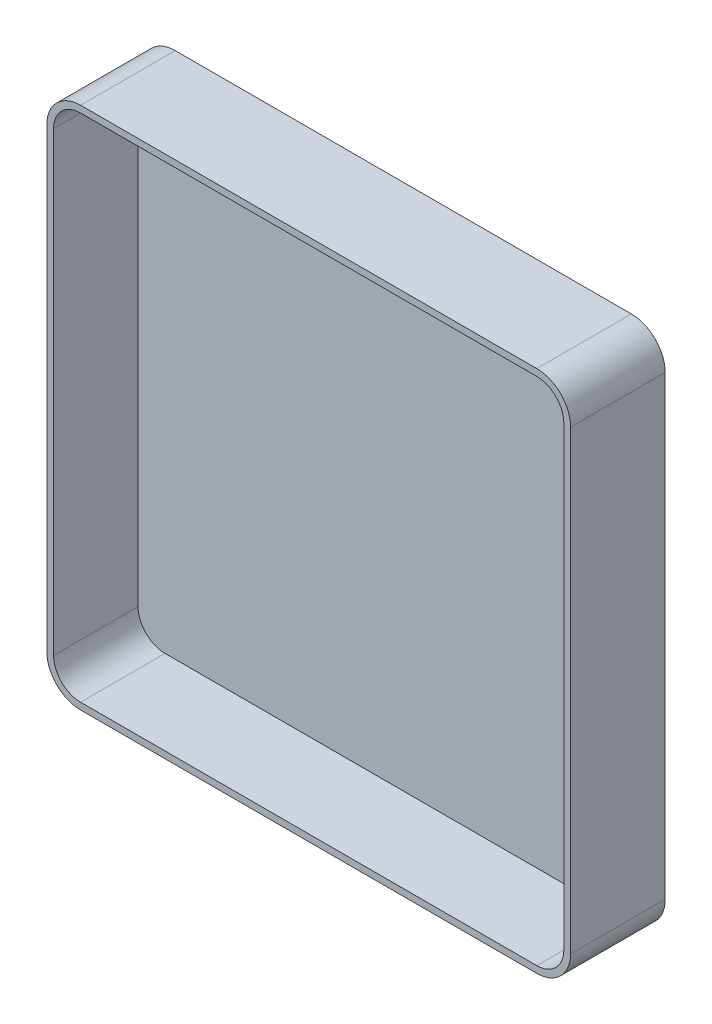
ISO-10303-21;
HEADER;
FILE_DESCRIPTION(('STEP AP214'),'2;1');
FILE_NAME('part.step','',(''),(''),'','','');
FILE_SCHEMA(('AUTOMOTIVE_DESIGN { 1 0 10303 214 1 1 1 1 }'));
ENDSEC;
DATA;
#1=APPLICATION_CONTEXT('core data for automotive mechanical design processes');
#2=APPLICATION_PROTOCOL_DEFINITION('international standard','automotive_design',2000,#1);
#3=PRODUCT_CONTEXT('',#1,'mechanical');
#4=PRODUCT('Part','Part','',(#3));
#5=PRODUCT_RELATED_PRODUCT_CATEGORY('part','',(#4));
#6=PRODUCT_DEFINITION_FORMATION('','',#4);
#7=PRODUCT_DEFINITION_CONTEXT('part definition',#1,'design');
#8=PRODUCT_DEFINITION('design','',#6,#7);
#9=PRODUCT_DEFINITION_SHAPE('','',#8);
#10=(LENGTH_UNIT() NAMED_UNIT(*) SI_UNIT(.MILLI.,.METRE.));
#11=(NAMED_UNIT(*) PLANE_ANGLE_UNIT() SI_UNIT($,.RADIAN.));
#12=(NAMED_UNIT(*) SI_UNIT($,.STERADIAN.) SOLID_ANGLE_UNIT());
#13=UNCERTAINTY_MEASURE_WITH_UNIT(LENGTH_MEASURE(1.E-05),#10,'distance_accuracy_value','');
#14=(GEOMETRIC_REPRESENTATION_CONTEXT(3) GLOBAL_UNCERTAINTY_ASSIGNED_CONTEXT((#13)) GLOBAL_UNIT_ASSIGNED_CONTEXT((#10,
#11,#12)) REPRESENTATION_CONTEXT('',''));
#15=CARTESIAN_POINT('',(0.,0.,0.));
#16=DIRECTION('',(0.,0.,1.));
#17=DIRECTION('',(1.,0.,0.));
#18=AXIS2_PLACEMENT_3D('',#15,#16,#17);
#19=CARTESIAN_POINT('',(414.301234579358,22.7440750856867,3.));
#20=DIRECTION('',(0.,0.,-1.));
#21=DIRECTION('',(-1.,0.,0.));
#22=AXIS2_PLACEMENT_3D('',#19,#20,#21);
#23=CYLINDRICAL_SURFACE('',#22,10.);
#24=CARTESIAN_POINT('',(414.301234579358,22.7440750856867,0.));
#25=DIRECTION('',(0.,0.,1.));
#26=DIRECTION('',(-1.,0.,0.));
#27=AXIS2_PLACEMENT_3D('',#24,#25,#26);
#28=CIRCLE('',#27,10.);
#29=CARTESIAN_POINT('',(404.301234579358,22.7440750856867,0.));
#30=VERTEX_POINT('',#29);
#31=CARTESIAN_POINT('',(414.301234579358,12.7440750856867,0.));
#32=VERTEX_POINT('',#31);
#33=EDGE_CURVE('E245',#30,#32,#28,.T.);
#34=ORIENTED_EDGE('',*,*,#33,.T.);
#35=DIRECTION('',(0.,0.,-1.));
#36=VECTOR('',#35,1.);
#37=CARTESIAN_POINT('',(414.301234579358,12.7440750856867,3.));
#38=LINE('',#37,#36);
#39=CARTESIAN_POINT('',(414.301234579358,12.7440750856867,28.));
#40=VERTEX_POINT('',#39);
#41=EDGE_CURVE('E11',#40,#32,#38,.T.);
#42=ORIENTED_EDGE('',*,*,#41,.F.);
#43=CARTESIAN_POINT('',(414.301234579358,22.7440750856867,28.));
#44=DIRECTION('',(0.,0.,1.));
#45=DIRECTION('',(1.,0.,0.));
#46=AXIS2_PLACEMENT_3D('',#43,#44,#45);
#47=CIRCLE('',#46,10.);
#48=CARTESIAN_POINT('',(404.301234579358,22.7440750856867,28.));
#49=VERTEX_POINT('',#48);
#50=EDGE_CURVE('E169',#49,#40,#47,.T.);
#51=ORIENTED_EDGE('',*,*,#50,.F.);
#52=DIRECTION('',(0.,0.,-1.));
#53=VECTOR('',#52,1.);
#54=CARTESIAN_POINT('',(404.301234579358,22.7440750856867,3.));
#55=LINE('',#54,#53);
#56=EDGE_CURVE('E261',#49,#30,#55,.T.);
#57=ORIENTED_EDGE('',*,*,#56,.T.);
#58=EDGE_LOOP('',(#34,#42,#51,#57));
#59=FACE_BOUND('',#58,.T.);
#60=ADVANCED_FACE('F39',(#59),#23,.T.);
#61=CARTESIAN_POINT('',(414.301234579358,12.7440750856867,3.));
#62=DIRECTION('',(0.,1.,0.));
#63=DIRECTION('',(0.,0.,1.));
#64=AXIS2_PLACEMENT_3D('',#61,#62,#63);
#65=PLANE('',#64);
#66=DIRECTION('',(1.,0.,0.));
#67=VECTOR('',#66,1.);
#68=CARTESIAN_POINT('',(414.301234579358,12.7440750856867,0.));
#69=LINE('',#68,#67);
#70=CARTESIAN_POINT('',(549.301234579366,12.7440750856867,0.));
#71=VERTEX_POINT('',#70);
#72=EDGE_CURVE('E248',#32,#71,#69,.T.);
#73=ORIENTED_EDGE('',*,*,#72,.T.);
#74=DIRECTION('',(0.,0.,-1.));
#75=VECTOR('',#74,1.);
#76=CARTESIAN_POINT('',(549.301234579366,12.7440750856867,3.));
#77=LINE('',#76,#75);
#78=CARTESIAN_POINT('',(549.301234579366,12.7440750856867,28.));
#79=VERTEX_POINT('',#78);
#80=EDGE_CURVE('E46',#79,#71,#77,.T.);
#81=ORIENTED_EDGE('',*,*,#80,.F.);
#82=DIRECTION('',(1.,0.,0.));
#83=VECTOR('',#82,1.);
#84=CARTESIAN_POINT('',(414.301234579358,12.7440750856867,28.));
#85=LINE('',#84,#83);
#86=EDGE_CURVE('E224',#40,#79,#85,.T.);
#87=ORIENTED_EDGE('',*,*,#86,.F.);
#88=ORIENTED_EDGE('',*,*,#41,.T.);
#89=EDGE_LOOP('',(#73,#81,#87,#88));
#90=FACE_BOUND('',#89,.T.);
#91=ADVANCED_FACE('F307',(#90),#65,.F.);
#92=CARTESIAN_POINT('',(549.301234579366,22.7440750856867,3.));
#93=DIRECTION('',(0.,0.,-1.));
#94=DIRECTION('',(-1.,0.,0.));
#95=AXIS2_PLACEMENT_3D('',#92,#93,#94);
#96=CYLINDRICAL_SURFACE('',#95,10.);
#97=CARTESIAN_POINT('',(549.301234579366,22.7440750856867,0.));
#98=DIRECTION('',(0.,0.,1.));
#99=DIRECTION('',(1.,0.,0.));
#100=AXIS2_PLACEMENT_3D('',#97,#98,#99);
#101=CIRCLE('',#100,10.);
#102=CARTESIAN_POINT('',(559.301234579366,22.7440750856867,0.));
#103=VERTEX_POINT('',#102);
#104=EDGE_CURVE('E250',#71,#103,#101,.T.);
#105=ORIENTED_EDGE('',*,*,#104,.T.);
#106=DIRECTION('',(0.,0.,-1.));
#107=VECTOR('',#106,1.);
#108=CARTESIAN_POINT('',(559.301234579366,22.7440750856867,3.));
#109=LINE('',#108,#107);
#110=CARTESIAN_POINT('',(559.301234579366,22.7440750856867,28.));
#111=VERTEX_POINT('',#110);
#112=EDGE_CURVE('E274',#111,#103,#109,.T.);
#113=ORIENTED_EDGE('',*,*,#112,.F.);
#114=CARTESIAN_POINT('',(549.301234579366,22.7440750856867,28.));
#115=DIRECTION('',(0.,0.,1.));
#116=DIRECTION('',(1.,0.,0.));
#117=AXIS2_PLACEMENT_3D('',#114,#115,#116);
#118=CIRCLE('',#117,10.);
#119=EDGE_CURVE('E227',#79,#111,#118,.T.);
#120=ORIENTED_EDGE('',*,*,#119,.F.);
#121=ORIENTED_EDGE('',*,*,#80,.T.);
#122=EDGE_LOOP('',(#105,#113,#120,#121));
#123=FACE_BOUND('',#122,.T.);
#124=ADVANCED_FACE('F280',(#123),#96,.T.);
#125=CARTESIAN_POINT('',(559.301234579366,22.7440750856867,3.));
#126=DIRECTION('',(-1.,0.,0.));
#127=DIRECTION('',(0.,0.,1.));
#128=AXIS2_PLACEMENT_3D('',#125,#126,#127);
#129=PLANE('',#128);
#130=DIRECTION('',(0.,1.,0.));
#131=VECTOR('',#130,1.);
#132=CARTESIAN_POINT('',(559.301234579366,22.7440750856867,0.));
#133=LINE('',#132,#131);
#134=CARTESIAN_POINT('',(559.301234579366,157.744075085687,0.));
#135=VERTEX_POINT('',#134);
#136=EDGE_CURVE('E252',#103,#135,#133,.T.);
#137=ORIENTED_EDGE('',*,*,#136,.T.);
#138=DIRECTION('',(0.,0.,-1.));
#139=VECTOR('',#138,1.);
#140=CARTESIAN_POINT('',(559.301234579366,157.744075085687,3.));
#141=LINE('',#140,#139);
#142=CARTESIAN_POINT('',(559.301234579366,157.744075085687,28.));
#143=VERTEX_POINT('',#142);
#144=EDGE_CURVE('E271',#143,#135,#141,.T.);
#145=ORIENTED_EDGE('',*,*,#144,.F.);
#146=DIRECTION('',(0.,1.,0.));
#147=VECTOR('',#146,1.);
#148=CARTESIAN_POINT('',(559.301234579366,22.7440750856867,28.));
#149=LINE('',#148,#147);
#150=EDGE_CURVE('E230',#111,#143,#149,.T.);
#151=ORIENTED_EDGE('',*,*,#150,.F.);
#152=ORIENTED_EDGE('',*,*,#112,.T.);
#153=EDGE_LOOP('',(#137,#145,#151,#152));
#154=FACE_BOUND('',#153,.T.);
#155=ADVANCED_FACE('F290',(#154),#129,.F.);
#156=CARTESIAN_POINT('',(549.301234579366,157.744075085687,3.));
#157=DIRECTION('',(0.,0.,-1.));
#158=DIRECTION('',(-1.,0.,0.));
#159=AXIS2_PLACEMENT_3D('',#156,#157,#158);
#160=CYLINDRICAL_SURFACE('',#159,10.);
#161=CARTESIAN_POINT('',(549.301234579366,157.744075085687,0.));
#162=DIRECTION('',(0.,0.,1.));
#163=DIRECTION('',(-1.,0.,0.));
#164=AXIS2_PLACEMENT_3D('',#161,#162,#163);
#165=CIRCLE('',#164,10.);
#166=CARTESIAN_POINT('',(549.301234579366,167.744075085687,0.));
#167=VERTEX_POINT('',#166);
#168=EDGE_CURVE('E254',#135,#167,#165,.T.);
#169=ORIENTED_EDGE('',*,*,#168,.T.);
#170=DIRECTION('',(0.,0.,-1.));
#171=VECTOR('',#170,1.);
#172=CARTESIAN_POINT('',(549.301234579366,167.744075085687,3.));
#173=LINE('',#172,#171);
#174=CARTESIAN_POINT('',(549.301234579366,167.744075085687,28.));
#175=VERTEX_POINT('',#174);
#176=EDGE_CURVE('E268',#175,#167,#173,.T.);
#177=ORIENTED_EDGE('',*,*,#176,.F.);
#178=CARTESIAN_POINT('',(549.301234579366,157.744075085687,28.));
#179=DIRECTION('',(0.,0.,1.));
#180=DIRECTION('',(1.,0.,0.));
#181=AXIS2_PLACEMENT_3D('',#178,#179,#180);
#182=CIRCLE('',#181,10.);
#183=EDGE_CURVE('E233',#143,#175,#182,.T.);
#184=ORIENTED_EDGE('',*,*,#183,.F.);
#185=ORIENTED_EDGE('',*,*,#144,.T.);
#186=EDGE_LOOP('',(#169,#177,#184,#185));
#187=FACE_BOUND('',#186,.T.);
#188=ADVANCED_FACE('F294',(#187),#160,.T.);
#189=CARTESIAN_POINT('',(414.301234579358,167.744075085687,3.));
#190=DIRECTION('',(0.,-1.,0.));
#191=DIRECTION('',(0.,0.,-1.));
#192=AXIS2_PLACEMENT_3D('',#189,#190,#191);
#193=PLANE('',#192);
#194=DIRECTION('',(-1.,0.,0.));
#195=VECTOR('',#194,1.);
#196=CARTESIAN_POINT('',(414.301234579358,167.744075085687,0.));
#197=LINE('',#196,#195);
#198=CARTESIAN_POINT('',(414.301234579358,167.744075085687,0.));
#199=VERTEX_POINT('',#198);
#200=EDGE_CURVE('E256',#167,#199,#197,.T.);
#201=ORIENTED_EDGE('',*,*,#200,.T.);
#202=DIRECTION('',(0.,0.,-1.));
#203=VECTOR('',#202,1.);
#204=CARTESIAN_POINT('',(414.301234579358,167.744075085687,3.));
#205=LINE('',#204,#203);
#206=CARTESIAN_POINT('',(414.301234579358,167.744075085687,28.));
#207=VERTEX_POINT('',#206);
#208=EDGE_CURVE('E265',#207,#199,#205,.T.);
#209=ORIENTED_EDGE('',*,*,#208,.F.);
#210=DIRECTION('',(-1.,0.,0.));
#211=VECTOR('',#210,1.);
#212=CARTESIAN_POINT('',(549.301234579366,167.744075085687,28.));
#213=LINE('',#212,#211);
#214=EDGE_CURVE('E236',#175,#207,#213,.T.);
#215=ORIENTED_EDGE('',*,*,#214,.F.);
#216=ORIENTED_EDGE('',*,*,#176,.T.);
#217=EDGE_LOOP('',(#201,#209,#215,#216));
#218=FACE_BOUND('',#217,.T.);
#219=ADVANCED_FACE('F299',(#218),#193,.F.);
#220=CARTESIAN_POINT('',(414.301234579358,157.744075085687,3.));
#221=DIRECTION('',(0.,0.,-1.));
#222=DIRECTION('',(-1.,0.,0.));
#223=AXIS2_PLACEMENT_3D('',#220,#221,#222);
#224=CYLINDRICAL_SURFACE('',#223,10.);
#225=CARTESIAN_POINT('',(414.301234579358,157.744075085687,0.));
#226=DIRECTION('',(0.,0.,1.));
#227=DIRECTION('',(1.,0.,0.));
#228=AXIS2_PLACEMENT_3D('',#225,#226,#227);
#229=CIRCLE('',#228,10.);
#230=CARTESIAN_POINT('',(404.301234579358,157.744075085687,0.));
#231=VERTEX_POINT('',#230);
#232=EDGE_CURVE('E258',#199,#231,#229,.T.);
#233=ORIENTED_EDGE('',*,*,#232,.T.);
#234=DIRECTION('',(0.,0.,-1.));
#235=VECTOR('',#234,1.);
#236=CARTESIAN_POINT('',(404.301234579358,157.744075085687,3.));
#237=LINE('',#236,#235);
#238=CARTESIAN_POINT('',(404.301234579358,157.744075085687,28.));
#239=VERTEX_POINT('',#238);
#240=EDGE_CURVE('E263',#239,#231,#237,.T.);
#241=ORIENTED_EDGE('',*,*,#240,.F.);
#242=CARTESIAN_POINT('',(414.301234579358,157.744075085687,28.));
#243=DIRECTION('',(0.,0.,1.));
#244=DIRECTION('',(1.,0.,0.));
#245=AXIS2_PLACEMENT_3D('',#242,#243,#244);
#246=CIRCLE('',#245,10.);
#247=EDGE_CURVE('E239',#207,#239,#246,.T.);
#248=ORIENTED_EDGE('',*,*,#247,.F.);
#249=ORIENTED_EDGE('',*,*,#208,.T.);
#250=EDGE_LOOP('',(#233,#241,#248,#249));
#251=FACE_BOUND('',#250,.T.);
#252=ADVANCED_FACE('F302',(#251),#224,.T.);
#253=CARTESIAN_POINT('',(404.301234579358,22.7440750856867,3.));
#254=DIRECTION('',(1.,0.,0.));
#255=DIRECTION('',(0.,0.,-1.));
#256=AXIS2_PLACEMENT_3D('',#253,#254,#255);
#257=PLANE('',#256);
#258=DIRECTION('',(0.,-1.,0.));
#259=VECTOR('',#258,1.);
#260=CARTESIAN_POINT('',(404.301234579358,22.7440750856867,0.));
#261=LINE('',#260,#259);
#262=EDGE_CURVE('E61',#231,#30,#261,.T.);
#263=ORIENTED_EDGE('',*,*,#262,.T.);
#264=ORIENTED_EDGE('',*,*,#56,.F.);
#265=DIRECTION('',(0.,-1.,0.));
#266=VECTOR('',#265,1.);
#267=CARTESIAN_POINT('',(404.301234579358,157.744075085687,28.));
#268=LINE('',#267,#266);
#269=EDGE_CURVE('E242',#239,#49,#268,.T.);
#270=ORIENTED_EDGE('',*,*,#269,.F.);
#271=ORIENTED_EDGE('',*,*,#240,.T.);
#272=EDGE_LOOP('',(#263,#264,#270,#271));
#273=FACE_BOUND('',#272,.T.);
#274=ADVANCED_FACE('F306',(#273),#257,.F.);
#275=CARTESIAN_POINT('',(414.301234579358,22.7440750856867,0.));
#276=DIRECTION('',(0.,0.,-1.));
#277=DIRECTION('',(-1.,0.,0.));
#278=AXIS2_PLACEMENT_3D('',#275,#276,#277);
#279=PLANE('',#278);
#280=ORIENTED_EDGE('',*,*,#33,.F.);
#281=ORIENTED_EDGE('',*,*,#262,.F.);
#282=ORIENTED_EDGE('',*,*,#232,.F.);
#283=ORIENTED_EDGE('',*,*,#200,.F.);
#284=ORIENTED_EDGE('',*,*,#168,.F.);
#285=ORIENTED_EDGE('',*,*,#136,.F.);
#286=ORIENTED_EDGE('',*,*,#104,.F.);
#287=ORIENTED_EDGE('',*,*,#72,.F.);
#288=EDGE_LOOP('',(#280,#281,#282,#283,#284,#285,#286,#287));
#289=FACE_BOUND('',#288,.T.);
#290=ADVANCED_FACE('F286',(#289),#279,.T.);
#291=CARTESIAN_POINT('',(414.301234579358,22.7440750856867,28.));
#292=DIRECTION('',(0.,0.,1.));
#293=DIRECTION('',(1.,0.,0.));
#294=AXIS2_PLACEMENT_3D('',#291,#292,#293);
#295=PLANE('',#294);
#296=ORIENTED_EDGE('',*,*,#50,.T.);
#297=ORIENTED_EDGE('',*,*,#86,.T.);
#298=ORIENTED_EDGE('',*,*,#119,.T.);
#299=ORIENTED_EDGE('',*,*,#150,.T.);
#300=ORIENTED_EDGE('',*,*,#183,.T.);
#301=ORIENTED_EDGE('',*,*,#214,.T.);
#302=ORIENTED_EDGE('',*,*,#247,.T.);
#303=ORIENTED_EDGE('',*,*,#269,.T.);
#304=EDGE_LOOP('',(#296,#297,#298,#299,#300,#301,#302,#303));
#305=FACE_BOUND('',#304,.T.);
#306=DIRECTION('',(0.,1.,0.));
#307=VECTOR('',#306,1.);
#308=CARTESIAN_POINT('',(557.301234579366,22.7440750856867,28.));
#309=LINE('',#308,#307);
#310=CARTESIAN_POINT('',(557.301234579366,22.7440750856867,28.));
#311=VERTEX_POINT('',#310);
#312=CARTESIAN_POINT('',(557.301234579366,157.744075085687,28.));
#313=VERTEX_POINT('',#312);
#314=EDGE_CURVE('E161',#311,#313,#309,.T.);
#315=ORIENTED_EDGE('',*,*,#314,.F.);
#316=CARTESIAN_POINT('',(549.301234579366,22.7440750856867,28.));
#317=DIRECTION('',(0.,0.,1.));
#318=DIRECTION('',(1.,0.,0.));
#319=AXIS2_PLACEMENT_3D('',#316,#317,#318);
#320=CIRCLE('',#319,8.);
#321=CARTESIAN_POINT('',(549.301234579366,14.7440750856867,28.));
#322=VERTEX_POINT('',#321);
#323=EDGE_CURVE('E153',#322,#311,#320,.T.);
#324=ORIENTED_EDGE('',*,*,#323,.F.);
#325=DIRECTION('',(1.,0.,0.));
#326=VECTOR('',#325,1.);
#327=CARTESIAN_POINT('',(414.301234579358,14.7440750856867,28.));
#328=LINE('',#327,#326);
#329=CARTESIAN_POINT('',(414.301234579358,14.7440750856867,28.));
#330=VERTEX_POINT('',#329);
#331=EDGE_CURVE('E188',#330,#322,#328,.T.);
#332=ORIENTED_EDGE('',*,*,#331,.F.);
#333=CARTESIAN_POINT('',(414.301234579358,22.7440750856867,28.));
#334=DIRECTION('',(0.,0.,1.));
#335=DIRECTION('',(1.,0.,0.));
#336=AXIS2_PLACEMENT_3D('',#333,#334,#335);
#337=CIRCLE('',#336,8.00000000000001);
#338=CARTESIAN_POINT('',(406.301234579358,22.7440750856867,28.));
#339=VERTEX_POINT('',#338);
#340=EDGE_CURVE('E185',#339,#330,#337,.T.);
#341=ORIENTED_EDGE('',*,*,#340,.F.);
#342=DIRECTION('',(0.,-1.,0.));
#343=VECTOR('',#342,1.);
#344=CARTESIAN_POINT('',(406.301234579358,157.744075085687,28.));
#345=LINE('',#344,#343);
#346=CARTESIAN_POINT('',(406.301234579358,157.744075085687,28.));
#347=VERTEX_POINT('',#346);
#348=EDGE_CURVE('E183',#347,#339,#345,.T.);
#349=ORIENTED_EDGE('',*,*,#348,.F.);
#350=CARTESIAN_POINT('',(414.301234579358,157.744075085687,28.));
#351=DIRECTION('',(0.,0.,1.));
#352=DIRECTION('',(1.,0.,0.));
#353=AXIS2_PLACEMENT_3D('',#350,#351,#352);
#354=CIRCLE('',#353,8.00000000000001);
#355=CARTESIAN_POINT('',(414.301234579358,165.744075085687,28.));
#356=VERTEX_POINT('',#355);
#357=EDGE_CURVE('E181',#356,#347,#354,.T.);
#358=ORIENTED_EDGE('',*,*,#357,.F.);
#359=DIRECTION('',(-1.,0.,0.));
#360=VECTOR('',#359,1.);
#361=CARTESIAN_POINT('',(549.301234579366,165.744075085687,28.));
#362=LINE('',#361,#360);
#363=CARTESIAN_POINT('',(549.301234579366,165.744075085687,28.));
#364=VERTEX_POINT('',#363);
#365=EDGE_CURVE('E177',#364,#356,#362,.T.);
#366=ORIENTED_EDGE('',*,*,#365,.F.);
#367=CARTESIAN_POINT('',(549.301234579366,157.744075085687,28.));
#368=DIRECTION('',(0.,0.,1.));
#369=DIRECTION('',(1.,0.,0.));
#370=AXIS2_PLACEMENT_3D('',#367,#368,#369);
#371=CIRCLE('',#370,8.00000000000001);
#372=EDGE_CURVE('E175',#313,#364,#371,.T.);
#373=ORIENTED_EDGE('',*,*,#372,.F.);
#374=EDGE_LOOP('',(#315,#324,#332,#341,#349,#358,#366,#373));
#375=FACE_BOUND('',#374,.T.);
#376=ADVANCED_FACE('F173',(#305,#375),#295,.T.);
#377=CARTESIAN_POINT('',(549.301234579366,22.7440750856867,28.));
#378=DIRECTION('',(0.,0.,-1.));
#379=DIRECTION('',(-1.,0.,0.));
#380=AXIS2_PLACEMENT_3D('',#377,#378,#379);
#381=CYLINDRICAL_SURFACE('',#380,8.);
#382=CARTESIAN_POINT('',(549.301234579366,22.7440750856867,3.));
#383=DIRECTION('',(0.,0.,1.));
#384=DIRECTION('',(1.,0.,0.));
#385=AXIS2_PLACEMENT_3D('',#382,#383,#384);
#386=CIRCLE('',#385,8.);
#387=CARTESIAN_POINT('',(549.301234579366,14.7440750856867,3.));
#388=VERTEX_POINT('',#387);
#389=CARTESIAN_POINT('',(557.301234579366,22.7440750856867,3.));
#390=VERTEX_POINT('',#389);
#391=EDGE_CURVE('E190',#388,#390,#386,.T.);
#392=ORIENTED_EDGE('',*,*,#391,.F.);
#393=DIRECTION('',(0.,0.,-1.));
#394=VECTOR('',#393,1.);
#395=CARTESIAN_POINT('',(549.301234579366,14.7440750856867,28.));
#396=LINE('',#395,#394);
#397=EDGE_CURVE('E53',#322,#388,#396,.T.);
#398=ORIENTED_EDGE('',*,*,#397,.F.);
#399=ORIENTED_EDGE('',*,*,#323,.T.);
#400=DIRECTION('',(0.,0.,-1.));
#401=VECTOR('',#400,1.);
#402=CARTESIAN_POINT('',(557.301234579366,22.7440750856867,28.));
#403=LINE('',#402,#401);
#404=EDGE_CURVE('E156',#311,#390,#403,.T.);
#405=ORIENTED_EDGE('',*,*,#404,.T.);
#406=EDGE_LOOP('',(#392,#398,#399,#405));
#407=FACE_BOUND('',#406,.T.);
#408=ADVANCED_FACE('F155',(#407),#381,.F.);
#409=CARTESIAN_POINT('',(557.301234579366,22.7440750856867,28.));
#410=DIRECTION('',(-1.,0.,0.));
#411=DIRECTION('',(0.,0.,1.));
#412=AXIS2_PLACEMENT_3D('',#409,#410,#411);
#413=PLANE('',#412);
#414=DIRECTION('',(0.,1.,0.));
#415=VECTOR('',#414,1.);
#416=CARTESIAN_POINT('',(557.301234579366,22.7440750856867,3.));
#417=LINE('',#416,#415);
#418=CARTESIAN_POINT('',(557.301234579366,157.744075085687,3.));
#419=VERTEX_POINT('',#418);
#420=EDGE_CURVE('E168',#390,#419,#417,.T.);
#421=ORIENTED_EDGE('',*,*,#420,.F.);
#422=ORIENTED_EDGE('',*,*,#404,.F.);
#423=ORIENTED_EDGE('',*,*,#314,.T.);
#424=DIRECTION('',(0.,0.,-1.));
#425=VECTOR('',#424,1.);
#426=CARTESIAN_POINT('',(557.301234579366,157.744075085687,28.));
#427=LINE('',#426,#425);
#428=EDGE_CURVE('E170',#313,#419,#427,.T.);
#429=ORIENTED_EDGE('',*,*,#428,.T.);
#430=EDGE_LOOP('',(#421,#422,#423,#429));
#431=FACE_BOUND('',#430,.T.);
#432=ADVANCED_FACE('F165',(#431),#413,.T.);
#433=CARTESIAN_POINT('',(549.301234579366,157.744075085687,28.));
#434=DIRECTION('',(0.,0.,-1.));
#435=DIRECTION('',(-1.,0.,0.));
#436=AXIS2_PLACEMENT_3D('',#433,#434,#435);
#437=CYLINDRICAL_SURFACE('',#436,8.00000000000001);
#438=CARTESIAN_POINT('',(549.301234579366,157.744075085687,3.));
#439=DIRECTION('',(0.,0.,1.));
#440=DIRECTION('',(1.,0.,0.));
#441=AXIS2_PLACEMENT_3D('',#438,#439,#440);
#442=CIRCLE('',#441,8.00000000000001);
#443=CARTESIAN_POINT('',(549.301234579366,165.744075085687,3.));
#444=VERTEX_POINT('',#443);
#445=EDGE_CURVE('E193',#419,#444,#442,.T.);
#446=ORIENTED_EDGE('',*,*,#445,.F.);
#447=ORIENTED_EDGE('',*,*,#428,.F.);
#448=ORIENTED_EDGE('',*,*,#372,.T.);
#449=DIRECTION('',(0.,0.,-1.));
#450=VECTOR('',#449,1.);
#451=CARTESIAN_POINT('',(549.301234579366,165.744075085687,28.));
#452=LINE('',#451,#450);
#453=EDGE_CURVE('E219',#364,#444,#452,.T.);
#454=ORIENTED_EDGE('',*,*,#453,.T.);
#455=EDGE_LOOP('',(#446,#447,#448,#454));
#456=FACE_BOUND('',#455,.T.);
#457=ADVANCED_FACE('F338',(#456),#437,.F.);
#458=CARTESIAN_POINT('',(549.301234579366,165.744075085687,28.));
#459=DIRECTION('',(0.,-1.,0.));
#460=DIRECTION('',(0.,0.,-1.));
#461=AXIS2_PLACEMENT_3D('',#458,#459,#460);
#462=PLANE('',#461);
#463=DIRECTION('',(-1.,0.,0.));
#464=VECTOR('',#463,1.);
#465=CARTESIAN_POINT('',(549.301234579366,165.744075085687,3.));
#466=LINE('',#465,#464);
#467=CARTESIAN_POINT('',(414.301234579358,165.744075085687,3.));
#468=VERTEX_POINT('',#467);
#469=EDGE_CURVE('E196',#444,#468,#466,.T.);
#470=ORIENTED_EDGE('',*,*,#469,.F.);
#471=ORIENTED_EDGE('',*,*,#453,.F.);
#472=ORIENTED_EDGE('',*,*,#365,.T.);
#473=DIRECTION('',(0.,0.,-1.));
#474=VECTOR('',#473,1.);
#475=CARTESIAN_POINT('',(414.301234579358,165.744075085687,28.));
#476=LINE('',#475,#474);
#477=EDGE_CURVE('E217',#356,#468,#476,.T.);
#478=ORIENTED_EDGE('',*,*,#477,.T.);
#479=EDGE_LOOP('',(#470,#471,#472,#478));
#480=FACE_BOUND('',#479,.T.);
#481=ADVANCED_FACE('F341',(#480),#462,.T.);
#482=CARTESIAN_POINT('',(414.301234579358,157.744075085687,28.));
#483=DIRECTION('',(0.,0.,-1.));
#484=DIRECTION('',(-1.,0.,0.));
#485=AXIS2_PLACEMENT_3D('',#482,#483,#484);
#486=CYLINDRICAL_SURFACE('',#485,8.00000000000001);
#487=CARTESIAN_POINT('',(414.301234579358,157.744075085687,3.));
#488=DIRECTION('',(0.,0.,1.));
#489=DIRECTION('',(1.,0.,0.));
#490=AXIS2_PLACEMENT_3D('',#487,#488,#489);
#491=CIRCLE('',#490,8.00000000000001);
#492=CARTESIAN_POINT('',(406.301234579358,157.744075085687,3.));
#493=VERTEX_POINT('',#492);
#494=EDGE_CURVE('E199',#468,#493,#491,.T.);
#495=ORIENTED_EDGE('',*,*,#494,.F.);
#496=ORIENTED_EDGE('',*,*,#477,.F.);
#497=ORIENTED_EDGE('',*,*,#357,.T.);
#498=DIRECTION('',(0.,0.,-1.));
#499=VECTOR('',#498,1.);
#500=CARTESIAN_POINT('',(406.301234579358,157.744075085687,28.));
#501=LINE('',#500,#499);
#502=EDGE_CURVE('E215',#347,#493,#501,.T.);
#503=ORIENTED_EDGE('',*,*,#502,.T.);
#504=EDGE_LOOP('',(#495,#496,#497,#503));
#505=FACE_BOUND('',#504,.T.);
#506=ADVANCED_FACE('F345',(#505),#486,.F.);
#507=CARTESIAN_POINT('',(406.301234579358,157.744075085687,28.));
#508=DIRECTION('',(1.,0.,0.));
#509=DIRECTION('',(0.,0.,-1.));
#510=AXIS2_PLACEMENT_3D('',#507,#508,#509);
#511=PLANE('',#510);
#512=DIRECTION('',(0.,-1.,0.));
#513=VECTOR('',#512,1.);
#514=CARTESIAN_POINT('',(406.301234579358,157.744075085687,3.));
#515=LINE('',#514,#513);
#516=CARTESIAN_POINT('',(406.301234579358,22.7440750856867,3.));
#517=VERTEX_POINT('',#516);
#518=EDGE_CURVE('E202',#493,#517,#515,.T.);
#519=ORIENTED_EDGE('',*,*,#518,.F.);
#520=ORIENTED_EDGE('',*,*,#502,.F.);
#521=ORIENTED_EDGE('',*,*,#348,.T.);
#522=DIRECTION('',(0.,0.,-1.));
#523=VECTOR('',#522,1.);
#524=CARTESIAN_POINT('',(406.301234579358,22.7440750856867,28.));
#525=LINE('',#524,#523);
#526=EDGE_CURVE('E213',#339,#517,#525,.T.);
#527=ORIENTED_EDGE('',*,*,#526,.T.);
#528=EDGE_LOOP('',(#519,#520,#521,#527));
#529=FACE_BOUND('',#528,.T.);
#530=ADVANCED_FACE('F349',(#529),#511,.T.);
#531=CARTESIAN_POINT('',(414.301234579358,22.7440750856867,28.));
#532=DIRECTION('',(0.,0.,-1.));
#533=DIRECTION('',(-1.,0.,0.));
#534=AXIS2_PLACEMENT_3D('',#531,#532,#533);
#535=CYLINDRICAL_SURFACE('',#534,8.00000000000001);
#536=CARTESIAN_POINT('',(414.301234579358,22.7440750856867,3.));
#537=DIRECTION('',(0.,0.,1.));
#538=DIRECTION('',(1.,0.,0.));
#539=AXIS2_PLACEMENT_3D('',#536,#537,#538);
#540=CIRCLE('',#539,8.00000000000001);
#541=CARTESIAN_POINT('',(414.301234579358,14.7440750856867,3.));
#542=VERTEX_POINT('',#541);
#543=EDGE_CURVE('E205',#517,#542,#540,.T.);
#544=ORIENTED_EDGE('',*,*,#543,.F.);
#545=ORIENTED_EDGE('',*,*,#526,.F.);
#546=ORIENTED_EDGE('',*,*,#340,.T.);
#547=DIRECTION('',(0.,0.,-1.));
#548=VECTOR('',#547,1.);
#549=CARTESIAN_POINT('',(414.301234579358,14.7440750856867,28.));
#550=LINE('',#549,#548);
#551=EDGE_CURVE('E211',#330,#542,#550,.T.);
#552=ORIENTED_EDGE('',*,*,#551,.T.);
#553=EDGE_LOOP('',(#544,#545,#546,#552));
#554=FACE_BOUND('',#553,.T.);
#555=ADVANCED_FACE('F353',(#554),#535,.F.);
#556=CARTESIAN_POINT('',(414.301234579358,14.7440750856867,28.));
#557=DIRECTION('',(0.,1.,0.));
#558=DIRECTION('',(-1.,0.,0.));
#559=AXIS2_PLACEMENT_3D('',#556,#557,#558);
#560=PLANE('',#559);
#561=DIRECTION('',(1.,0.,0.));
#562=VECTOR('',#561,1.);
#563=CARTESIAN_POINT('',(414.301234579358,14.7440750856867,3.));
#564=LINE('',#563,#562);
#565=EDGE_CURVE('E162',#542,#388,#564,.T.);
#566=ORIENTED_EDGE('',*,*,#565,.F.);
#567=ORIENTED_EDGE('',*,*,#551,.F.);
#568=ORIENTED_EDGE('',*,*,#331,.T.);
#569=ORIENTED_EDGE('',*,*,#397,.T.);
#570=EDGE_LOOP('',(#566,#567,#568,#569));
#571=FACE_BOUND('',#570,.T.);
#572=ADVANCED_FACE('F330',(#571),#560,.T.);
#573=CARTESIAN_POINT('',(414.301234579358,22.7440750856867,3.));
#574=DIRECTION('',(0.,0.,-1.));
#575=DIRECTION('',(-1.,0.,0.));
#576=AXIS2_PLACEMENT_3D('',#573,#574,#575);
#577=PLANE('',#576);
#578=ORIENTED_EDGE('',*,*,#565,.T.);
#579=ORIENTED_EDGE('',*,*,#391,.T.);
#580=ORIENTED_EDGE('',*,*,#420,.T.);
#581=ORIENTED_EDGE('',*,*,#445,.T.);
#582=ORIENTED_EDGE('',*,*,#469,.T.);
#583=ORIENTED_EDGE('',*,*,#494,.T.);
#584=ORIENTED_EDGE('',*,*,#518,.T.);
#585=ORIENTED_EDGE('',*,*,#543,.T.);
#586=EDGE_LOOP('',(#578,#579,#580,#581,#582,#583,#584,#585));
#587=FACE_BOUND('',#586,.T.);
#588=ADVANCED_FACE('F327',(#587),#577,.F.);
#589=CLOSED_SHELL('',(#60,#91,#124,#155,#188,#219,#252,#274,#290,#376,#408,#432,#457,#481,#506,
#530,#555,#572,#588));
#590=MANIFOLD_SOLID_BREP('B2',#589);
#591=ADVANCED_BREP_SHAPE_REPRESENTATION('',(#18,#590),#14);
#592=SHAPE_DEFINITION_REPRESENTATION(#9,#591);
ENDSEC;
END-ISO-10303-21;
